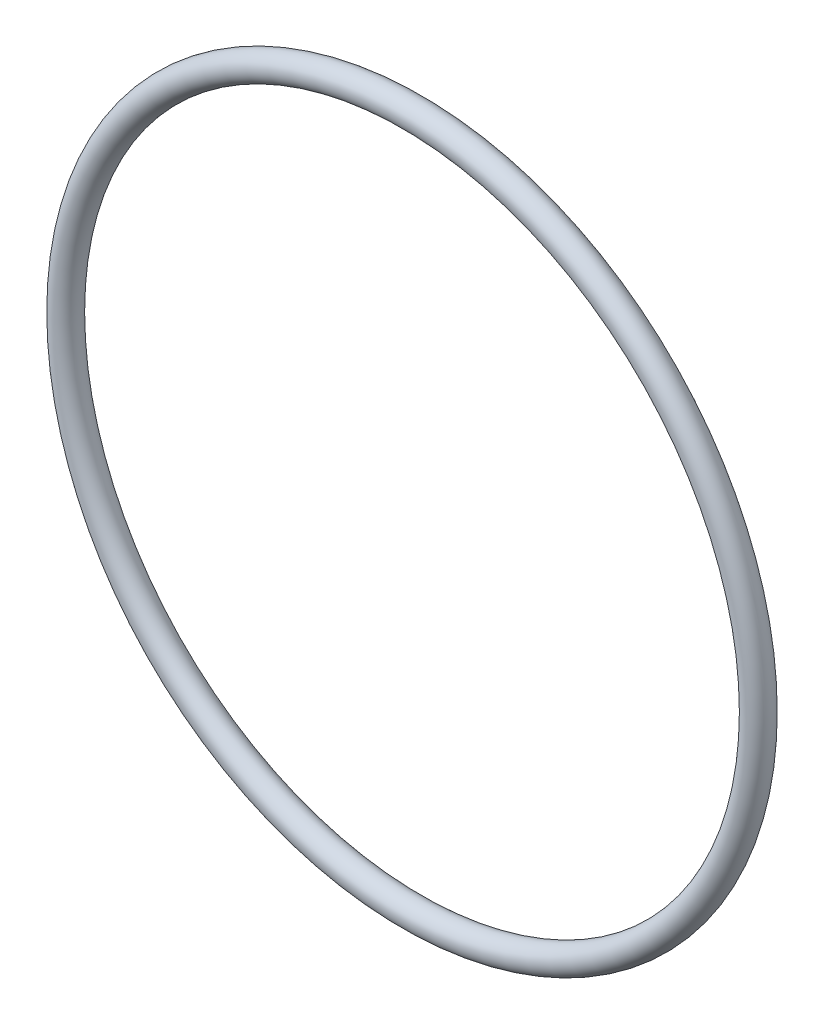
ISO-10303-21;
HEADER;
FILE_DESCRIPTION(('STEP AP214'),'2;1');
FILE_NAME('part.step','',(''),(''),'','','');
FILE_SCHEMA(('AUTOMOTIVE_DESIGN { 1 0 10303 214 1 1 1 1 }'));
ENDSEC;
DATA;
#1=APPLICATION_CONTEXT('core data for automotive mechanical design processes');
#2=APPLICATION_PROTOCOL_DEFINITION('international standard','automotive_design',2000,#1);
#3=PRODUCT_CONTEXT('',#1,'mechanical');
#4=PRODUCT('Part','Part','',(#3));
#5=PRODUCT_RELATED_PRODUCT_CATEGORY('part','',(#4));
#6=PRODUCT_DEFINITION_FORMATION('','',#4);
#7=PRODUCT_DEFINITION_CONTEXT('part definition',#1,'design');
#8=PRODUCT_DEFINITION('design','',#6,#7);
#9=PRODUCT_DEFINITION_SHAPE('','',#8);
#10=(LENGTH_UNIT() NAMED_UNIT(*) SI_UNIT(.MILLI.,.METRE.));
#11=(NAMED_UNIT(*) PLANE_ANGLE_UNIT() SI_UNIT($,.RADIAN.));
#12=(NAMED_UNIT(*) SI_UNIT($,.STERADIAN.) SOLID_ANGLE_UNIT());
#13=UNCERTAINTY_MEASURE_WITH_UNIT(LENGTH_MEASURE(1.E-05),#10,'distance_accuracy_value','');
#14=(GEOMETRIC_REPRESENTATION_CONTEXT(3) GLOBAL_UNCERTAINTY_ASSIGNED_CONTEXT((#13)) GLOBAL_UNIT_ASSIGNED_CONTEXT((#10,
#11,#12)) REPRESENTATION_CONTEXT('',''));
#15=CARTESIAN_POINT('',(0.,0.,0.));
#16=DIRECTION('',(0.,0.,1.));
#17=DIRECTION('',(1.,0.,0.));
#18=AXIS2_PLACEMENT_3D('',#15,#16,#17);
#19=CARTESIAN_POINT('',(0.,0.,0.));
#20=DIRECTION('',(0.,0.,1.));
#21=DIRECTION('',(1.,0.,0.));
#22=AXIS2_PLACEMENT_3D('',#19,#20,#21);
#23=TOROIDAL_SURFACE('',#22,22.9743,0.888999999999996);
#24=CARTESIAN_POINT('',(23.8633,0.,0.));
#25=VERTEX_POINT('',#24);
#26=VERTEX_LOOP('',#25);
#27=FACE_BOUND('',#26,.T.);
#28=ADVANCED_FACE('F35',(#27),#23,.T.);
#29=CLOSED_SHELL('',(#28));
#30=MANIFOLD_SOLID_BREP('B2',#29);
#31=ADVANCED_BREP_SHAPE_REPRESENTATION('',(#18,#30),#14);
#32=SHAPE_DEFINITION_REPRESENTATION(#9,#31);
ENDSEC;
END-ISO-10303-21;
